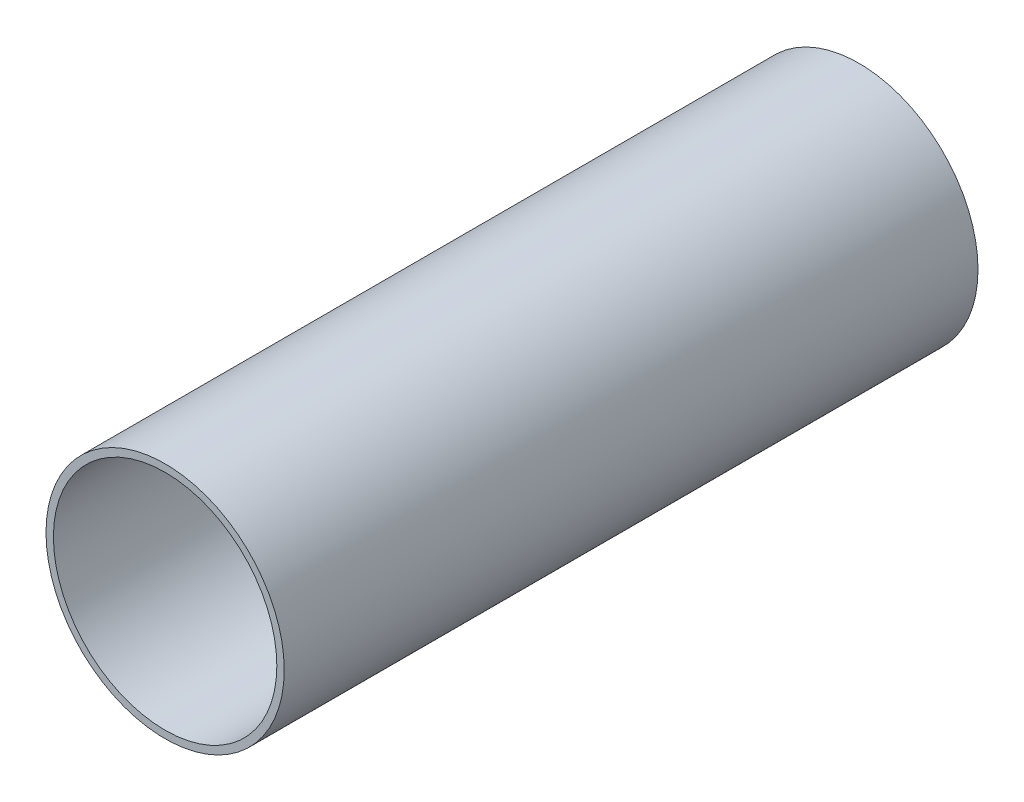
ISO-10303-21;
HEADER;
FILE_DESCRIPTION(('STEP AP214'),'2;1');
FILE_NAME('part.step','',(''),(''),'','','');
FILE_SCHEMA(('AUTOMOTIVE_DESIGN { 1 0 10303 214 1 1 1 1 }'));
ENDSEC;
DATA;
#1=APPLICATION_CONTEXT('core data for automotive mechanical design processes');
#2=APPLICATION_PROTOCOL_DEFINITION('international standard','automotive_design',2000,#1);
#3=PRODUCT_CONTEXT('',#1,'mechanical');
#4=PRODUCT('Part','Part','',(#3));
#5=PRODUCT_RELATED_PRODUCT_CATEGORY('part','',(#4));
#6=PRODUCT_DEFINITION_FORMATION('','',#4);
#7=PRODUCT_DEFINITION_CONTEXT('part definition',#1,'design');
#8=PRODUCT_DEFINITION('design','',#6,#7);
#9=PRODUCT_DEFINITION_SHAPE('','',#8);
#10=(LENGTH_UNIT() NAMED_UNIT(*) SI_UNIT(.MILLI.,.METRE.));
#11=(NAMED_UNIT(*) PLANE_ANGLE_UNIT() SI_UNIT($,.RADIAN.));
#12=(NAMED_UNIT(*) SI_UNIT($,.STERADIAN.) SOLID_ANGLE_UNIT());
#13=UNCERTAINTY_MEASURE_WITH_UNIT(LENGTH_MEASURE(1.E-05),#10,'distance_accuracy_value','');
#14=(GEOMETRIC_REPRESENTATION_CONTEXT(3) GLOBAL_UNCERTAINTY_ASSIGNED_CONTEXT((#13)) GLOBAL_UNIT_ASSIGNED_CONTEXT((#10,
#11,#12)) REPRESENTATION_CONTEXT('',''));
#15=CARTESIAN_POINT('',(0.,0.,0.));
#16=DIRECTION('',(0.,0.,1.));
#17=DIRECTION('',(1.,0.,0.));
#18=AXIS2_PLACEMENT_3D('',#15,#16,#17);
#19=CARTESIAN_POINT('',(0.,0.,590.));
#20=DIRECTION('',(0.,0.,1.));
#21=DIRECTION('',(1.,0.,0.));
#22=AXIS2_PLACEMENT_3D('',#19,#20,#21);
#23=PLANE('',#22);
#24=CARTESIAN_POINT('',(0.,0.,590.));
#25=DIRECTION('',(0.,0.,1.));
#26=DIRECTION('',(1.,0.,0.));
#27=AXIS2_PLACEMENT_3D('',#24,#25,#26);
#28=CIRCLE('',#27,101.3);
#29=CARTESIAN_POINT('',(101.3,0.,590.));
#30=VERTEX_POINT('',#29);
#31=EDGE_CURVE('E10',#30,#30,#28,.T.);
#32=ORIENTED_EDGE('',*,*,#31,.T.);
#33=EDGE_LOOP('',(#32));
#34=FACE_BOUND('',#33,.T.);
#35=CARTESIAN_POINT('',(0.,0.,590.));
#36=DIRECTION('',(0.,0.,1.));
#37=DIRECTION('',(1.,0.,0.));
#38=AXIS2_PLACEMENT_3D('',#35,#36,#37);
#39=CIRCLE('',#38,95.);
#40=CARTESIAN_POINT('',(95.,0.,590.));
#41=VERTEX_POINT('',#40);
#42=EDGE_CURVE('E52',#41,#41,#39,.T.);
#43=ORIENTED_EDGE('',*,*,#42,.F.);
#44=EDGE_LOOP('',(#43));
#45=FACE_BOUND('',#44,.T.);
#46=ADVANCED_FACE('F38',(#34,#45),#23,.T.);
#47=CARTESIAN_POINT('',(0.,0.,0.));
#48=DIRECTION('',(0.,0.,1.));
#49=DIRECTION('',(1.,0.,0.));
#50=AXIS2_PLACEMENT_3D('',#47,#48,#49);
#51=PLANE('',#50);
#52=CARTESIAN_POINT('',(0.,0.,0.));
#53=DIRECTION('',(0.,0.,1.));
#54=DIRECTION('',(1.,0.,0.));
#55=AXIS2_PLACEMENT_3D('',#52,#53,#54);
#56=CIRCLE('',#55,101.3);
#57=CARTESIAN_POINT('',(101.3,0.,0.));
#58=VERTEX_POINT('',#57);
#59=EDGE_CURVE('E42',#58,#58,#56,.T.);
#60=ORIENTED_EDGE('',*,*,#59,.F.);
#61=EDGE_LOOP('',(#60));
#62=FACE_BOUND('',#61,.T.);
#63=CARTESIAN_POINT('',(0.,0.,0.));
#64=DIRECTION('',(0.,0.,1.));
#65=DIRECTION('',(1.,0.,0.));
#66=AXIS2_PLACEMENT_3D('',#63,#64,#65);
#67=CIRCLE('',#66,95.);
#68=CARTESIAN_POINT('',(95.,0.,0.));
#69=VERTEX_POINT('',#68);
#70=EDGE_CURVE('E54',#69,#69,#67,.T.);
#71=ORIENTED_EDGE('',*,*,#70,.T.);
#72=EDGE_LOOP('',(#71));
#73=FACE_BOUND('',#72,.T.);
#74=ADVANCED_FACE('F65',(#62,#73),#51,.F.);
#75=CARTESIAN_POINT('',(0.,0.,590.));
#76=DIRECTION('',(0.,0.,-1.));
#77=DIRECTION('',(-1.,0.,0.));
#78=AXIS2_PLACEMENT_3D('',#75,#76,#77);
#79=CYLINDRICAL_SURFACE('',#78,101.3);
#80=ORIENTED_EDGE('',*,*,#31,.F.);
#81=EDGE_LOOP('',(#80));
#82=FACE_BOUND('',#81,.T.);
#83=ORIENTED_EDGE('',*,*,#59,.T.);
#84=EDGE_LOOP('',(#83));
#85=FACE_BOUND('',#84,.T.);
#86=ADVANCED_FACE('F40',(#82,#85),#79,.T.);
#87=CARTESIAN_POINT('',(0.,0.,590.));
#88=DIRECTION('',(0.,0.,-1.));
#89=DIRECTION('',(-1.,0.,0.));
#90=AXIS2_PLACEMENT_3D('',#87,#88,#89);
#91=CYLINDRICAL_SURFACE('',#90,95.);
#92=ORIENTED_EDGE('',*,*,#42,.T.);
#93=EDGE_LOOP('',(#92));
#94=FACE_BOUND('',#93,.T.);
#95=ORIENTED_EDGE('',*,*,#70,.F.);
#96=EDGE_LOOP('',(#95));
#97=FACE_BOUND('',#96,.T.);
#98=ADVANCED_FACE('F61',(#94,#97),#91,.F.);
#99=CLOSED_SHELL('',(#46,#74,#86,#98));
#100=MANIFOLD_SOLID_BREP('B2',#99);
#101=ADVANCED_BREP_SHAPE_REPRESENTATION('',(#18,#100),#14);
#102=SHAPE_DEFINITION_REPRESENTATION(#9,#101);
ENDSEC;
END-ISO-10303-21;
